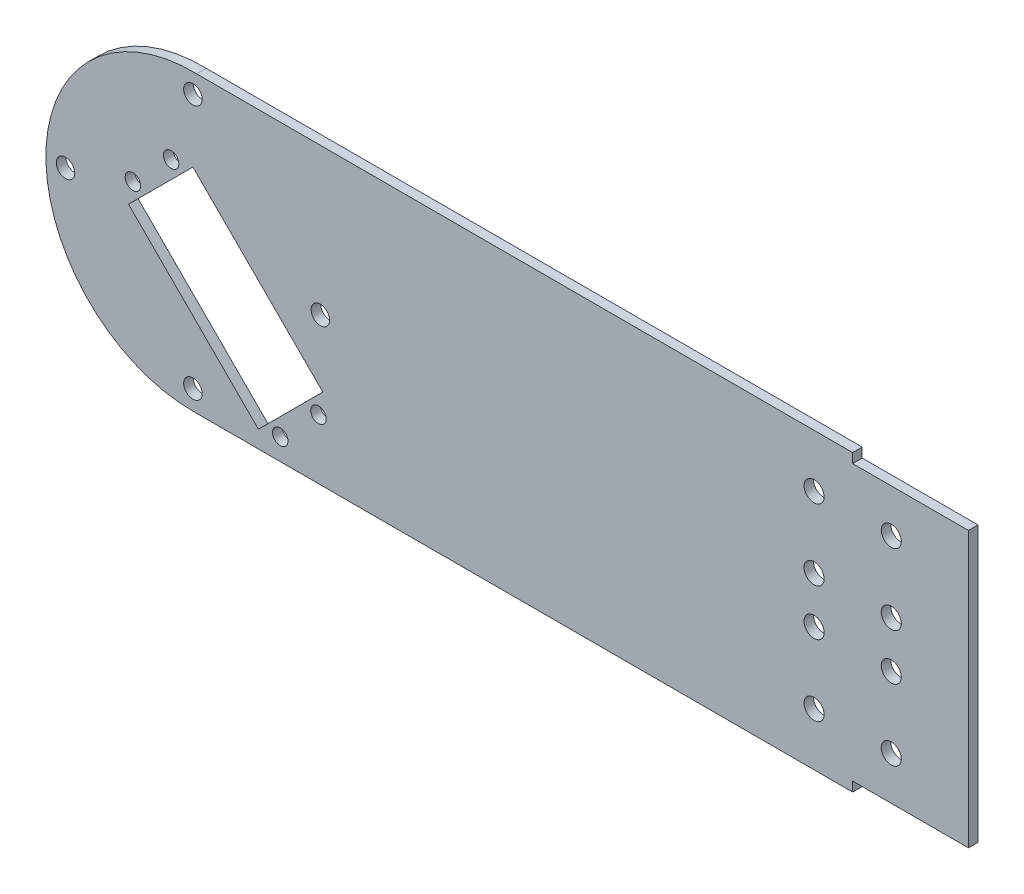
ISO-10303-21;
HEADER;
FILE_DESCRIPTION(('STEP AP214'),'2;1');
FILE_NAME('part.step','',(''),(''),'','','');
FILE_SCHEMA(('AUTOMOTIVE_DESIGN { 1 0 10303 214 1 1 1 1 }'));
ENDSEC;
DATA;
#1=APPLICATION_CONTEXT('core data for automotive mechanical design processes');
#2=APPLICATION_PROTOCOL_DEFINITION('international standard','automotive_design',2000,#1);
#3=PRODUCT_CONTEXT('',#1,'mechanical');
#4=PRODUCT('Part','Part','',(#3));
#5=PRODUCT_RELATED_PRODUCT_CATEGORY('part','',(#4));
#6=PRODUCT_DEFINITION_FORMATION('','',#4);
#7=PRODUCT_DEFINITION_CONTEXT('part definition',#1,'design');
#8=PRODUCT_DEFINITION('design','',#6,#7);
#9=PRODUCT_DEFINITION_SHAPE('','',#8);
#10=(LENGTH_UNIT() NAMED_UNIT(*) SI_UNIT(.MILLI.,.METRE.));
#11=(NAMED_UNIT(*) PLANE_ANGLE_UNIT() SI_UNIT($,.RADIAN.));
#12=(NAMED_UNIT(*) SI_UNIT($,.STERADIAN.) SOLID_ANGLE_UNIT());
#13=UNCERTAINTY_MEASURE_WITH_UNIT(LENGTH_MEASURE(1.E-05),#10,'distance_accuracy_value','');
#14=(GEOMETRIC_REPRESENTATION_CONTEXT(3) GLOBAL_UNCERTAINTY_ASSIGNED_CONTEXT((#13)) GLOBAL_UNIT_ASSIGNED_CONTEXT((#10,
#11,#12)) REPRESENTATION_CONTEXT('',''));
#15=CARTESIAN_POINT('',(0.,0.,0.));
#16=DIRECTION('',(0.,0.,1.));
#17=DIRECTION('',(1.,0.,0.));
#18=AXIS2_PLACEMENT_3D('',#15,#16,#17);
#19=CARTESIAN_POINT('',(0.,0.,3.1));
#20=DIRECTION('',(0.,0.,1.));
#21=DIRECTION('',(1.,0.,0.));
#22=AXIS2_PLACEMENT_3D('',#19,#20,#21);
#23=PLANE('',#22);
#24=CARTESIAN_POINT('',(201.19692414144,30.5249999999998,3.1));
#25=DIRECTION('',(0.,0.,1.));
#26=DIRECTION('',(-1.,0.,0.));
#27=AXIS2_PLACEMENT_3D('',#24,#25,#26);
#28=CIRCLE('',#27,3.25000000000001);
#29=CARTESIAN_POINT('',(197.94692414144,30.5249999999998,3.1));
#30=VERTEX_POINT('',#29);
#31=EDGE_CURVE('E460',#30,#30,#28,.T.);
#32=ORIENTED_EDGE('',*,*,#31,.F.);
#33=EDGE_LOOP('',(#32));
#34=FACE_BOUND('',#33,.T.);
#35=CARTESIAN_POINT('',(201.19692414144,7.52499999999982,3.1));
#36=DIRECTION('',(0.,0.,1.));
#37=DIRECTION('',(-1.,0.,0.));
#38=AXIS2_PLACEMENT_3D('',#35,#36,#37);
#39=CIRCLE('',#38,3.25000000000001);
#40=CARTESIAN_POINT('',(197.94692414144,7.52499999999982,3.1));
#41=VERTEX_POINT('',#40);
#42=EDGE_CURVE('E462',#41,#41,#39,.T.);
#43=ORIENTED_EDGE('',*,*,#42,.F.);
#44=EDGE_LOOP('',(#43));
#45=FACE_BOUND('',#44,.T.);
#46=CARTESIAN_POINT('',(201.19692414144,-7.52500000000017,3.1));
#47=DIRECTION('',(0.,0.,1.));
#48=DIRECTION('',(1.,0.,0.));
#49=AXIS2_PLACEMENT_3D('',#46,#47,#48);
#50=CIRCLE('',#49,3.25000000000001);
#51=CARTESIAN_POINT('',(204.44692414144,-7.52500000000017,3.1));
#52=VERTEX_POINT('',#51);
#53=EDGE_CURVE('E468',#52,#52,#50,.T.);
#54=ORIENTED_EDGE('',*,*,#53,.F.);
#55=EDGE_LOOP('',(#54));
#56=FACE_BOUND('',#55,.T.);
#57=CARTESIAN_POINT('',(201.19692414144,-30.5250000000002,3.1));
#58=DIRECTION('',(0.,0.,1.));
#59=DIRECTION('',(1.,0.,0.));
#60=AXIS2_PLACEMENT_3D('',#57,#58,#59);
#61=CIRCLE('',#60,3.25000000000001);
#62=CARTESIAN_POINT('',(204.44692414144,-30.5250000000002,3.1));
#63=VERTEX_POINT('',#62);
#64=EDGE_CURVE('E474',#63,#63,#61,.T.);
#65=ORIENTED_EDGE('',*,*,#64,.F.);
#66=EDGE_LOOP('',(#65));
#67=FACE_BOUND('',#66,.T.);
#68=CARTESIAN_POINT('',(226.19692414144,30.525,3.1));
#69=DIRECTION('',(0.,0.,1.));
#70=DIRECTION('',(-1.,0.,0.));
#71=AXIS2_PLACEMENT_3D('',#68,#69,#70);
#72=CIRCLE('',#71,3.25000000000001);
#73=CARTESIAN_POINT('',(222.94692414144,30.525,3.1));
#74=VERTEX_POINT('',#73);
#75=EDGE_CURVE('E480',#74,#74,#72,.T.);
#76=ORIENTED_EDGE('',*,*,#75,.F.);
#77=EDGE_LOOP('',(#76));
#78=FACE_BOUND('',#77,.T.);
#79=CARTESIAN_POINT('',(226.19692414144,7.52499999999999,3.1));
#80=DIRECTION('',(0.,0.,1.));
#81=DIRECTION('',(-1.,0.,0.));
#82=AXIS2_PLACEMENT_3D('',#79,#80,#81);
#83=CIRCLE('',#82,3.25000000000001);
#84=CARTESIAN_POINT('',(222.94692414144,7.52499999999999,3.1));
#85=VERTEX_POINT('',#84);
#86=EDGE_CURVE('E486',#85,#85,#83,.T.);
#87=ORIENTED_EDGE('',*,*,#86,.F.);
#88=EDGE_LOOP('',(#87));
#89=FACE_BOUND('',#88,.T.);
#90=CARTESIAN_POINT('',(226.19692414144,-7.525,3.1));
#91=DIRECTION('',(0.,0.,1.));
#92=DIRECTION('',(1.,0.,0.));
#93=AXIS2_PLACEMENT_3D('',#90,#91,#92);
#94=CIRCLE('',#93,3.25000000000001);
#95=CARTESIAN_POINT('',(229.44692414144,-7.525,3.1));
#96=VERTEX_POINT('',#95);
#97=EDGE_CURVE('E492',#96,#96,#94,.T.);
#98=ORIENTED_EDGE('',*,*,#97,.F.);
#99=EDGE_LOOP('',(#98));
#100=FACE_BOUND('',#99,.T.);
#101=CARTESIAN_POINT('',(226.19692414144,-30.525,3.1));
#102=DIRECTION('',(0.,0.,1.));
#103=DIRECTION('',(1.,0.,0.));
#104=AXIS2_PLACEMENT_3D('',#101,#102,#103);
#105=CIRCLE('',#104,3.25000000000001);
#106=CARTESIAN_POINT('',(229.44692414144,-30.525,3.1));
#107=VERTEX_POINT('',#106);
#108=EDGE_CURVE('E205',#107,#107,#105,.T.);
#109=ORIENTED_EDGE('',*,*,#108,.F.);
#110=EDGE_LOOP('',(#109));
#111=FACE_BOUND('',#110,.T.);
#112=CARTESIAN_POINT('',(28.2842712474618,-40.6586399182266,3.1));
#113=DIRECTION('',(0.,0.,-1.));
#114=DIRECTION('',(-1.,0.,0.));
#115=AXIS2_PLACEMENT_3D('',#112,#113,#114);
#116=CIRCLE('',#115,2.50000000000001);
#117=CARTESIAN_POINT('',(25.7842712474618,-40.6586399182266,3.1));
#118=VERTEX_POINT('',#117);
#119=EDGE_CURVE('E234',#118,#118,#116,.T.);
#120=ORIENTED_EDGE('',*,*,#119,.T.);
#121=EDGE_LOOP('',(#120));
#122=FACE_BOUND('',#121,.T.);
#123=CARTESIAN_POINT('',(40.6586399182264,-28.2842712474621,3.1));
#124=DIRECTION('',(0.,0.,1.));
#125=DIRECTION('',(1.,0.,0.));
#126=AXIS2_PLACEMENT_3D('',#123,#124,#125);
#127=CIRCLE('',#126,2.5);
#128=CARTESIAN_POINT('',(43.1586399182264,-28.2842712474621,3.1));
#129=VERTEX_POINT('',#128);
#130=EDGE_CURVE('E240',#129,#129,#127,.T.);
#131=ORIENTED_EDGE('',*,*,#130,.F.);
#132=EDGE_LOOP('',(#131));
#133=FACE_BOUND('',#132,.T.);
#134=CARTESIAN_POINT('',(-7.07106781186548,19.4454364826301,3.1));
#135=DIRECTION('',(0.,0.,-1.));
#136=DIRECTION('',(-1.,0.,0.));
#137=AXIS2_PLACEMENT_3D('',#134,#135,#136);
#138=CIRCLE('',#137,2.5);
#139=CARTESIAN_POINT('',(-9.57106781186548,19.4454364826301,3.1));
#140=VERTEX_POINT('',#139);
#141=EDGE_CURVE('E269',#140,#140,#138,.T.);
#142=ORIENTED_EDGE('',*,*,#141,.T.);
#143=EDGE_LOOP('',(#142));
#144=FACE_BOUND('',#143,.T.);
#145=CARTESIAN_POINT('',(5.73843931170054E-13,41.275,3.1));
#146=DIRECTION('',(0.,0.,1.));
#147=DIRECTION('',(1.,0.,0.));
#148=AXIS2_PLACEMENT_3D('',#145,#146,#147);
#149=CIRCLE('',#148,3.);
#150=CARTESIAN_POINT('',(3.00000000000058,41.275,3.1));
#151=VERTEX_POINT('',#150);
#152=EDGE_CURVE('E290',#151,#151,#149,.T.);
#153=ORIENTED_EDGE('',*,*,#152,.F.);
#154=EDGE_LOOP('',(#153));
#155=FACE_BOUND('',#154,.T.);
#156=CARTESIAN_POINT('',(0.,-41.275,3.1));
#157=DIRECTION('',(0.,0.,1.));
#158=DIRECTION('',(1.,0.,0.));
#159=AXIS2_PLACEMENT_3D('',#156,#157,#158);
#160=CIRCLE('',#159,3.);
#161=CARTESIAN_POINT('',(3.,-41.275,3.1));
#162=VERTEX_POINT('',#161);
#163=EDGE_CURVE('E302',#162,#162,#160,.T.);
#164=ORIENTED_EDGE('',*,*,#163,.F.);
#165=EDGE_LOOP('',(#164));
#166=FACE_BOUND('',#165,.T.);
#167=CARTESIAN_POINT('',(-41.2749999999997,2.8796409701215E-13,3.1));
#168=DIRECTION('',(0.,0.,1.));
#169=DIRECTION('',(1.,0.,0.));
#170=AXIS2_PLACEMENT_3D('',#167,#168,#169);
#171=CIRCLE('',#170,3.);
#172=CARTESIAN_POINT('',(-38.2749999999997,2.8796409701215E-13,3.1));
#173=VERTEX_POINT('',#172);
#174=EDGE_CURVE('E296',#173,#173,#171,.T.);
#175=ORIENTED_EDGE('',*,*,#174,.F.);
#176=EDGE_LOOP('',(#175));
#177=FACE_BOUND('',#176,.T.);
#178=CARTESIAN_POINT('',(41.2750000000003,-2.88397777881144E-13,3.1));
#179=DIRECTION('',(0.,0.,1.));
#180=DIRECTION('',(1.,0.,0.));
#181=AXIS2_PLACEMENT_3D('',#178,#179,#180);
#182=CIRCLE('',#181,3.);
#183=CARTESIAN_POINT('',(44.2750000000003,-2.88397777881144E-13,3.1));
#184=VERTEX_POINT('',#183);
#185=EDGE_CURVE('E284',#184,#184,#182,.T.);
#186=ORIENTED_EDGE('',*,*,#185,.F.);
#187=EDGE_LOOP('',(#186));
#188=FACE_BOUND('',#187,.T.);
#189=DIRECTION('',(0.707106781186544,0.707106781186551,0.));
#190=VECTOR('',#189,1.);
#191=CARTESIAN_POINT('',(21.2132034355965,-42.0728534805997,3.1));
#192=LINE('',#191,#190);
#193=CARTESIAN_POINT('',(21.2132034355965,-42.0728534805997,3.1));
#194=VERTEX_POINT('',#193);
#195=CARTESIAN_POINT('',(42.0728534805995,-21.2132034355965,3.1));
#196=VERTEX_POINT('',#195);
#197=EDGE_CURVE('E256',#194,#196,#192,.T.);
#198=ORIENTED_EDGE('',*,*,#197,.F.);
#199=DIRECTION('',(-0.707106781186546,0.707106781186549,0.));
#200=VECTOR('',#199,1.);
#201=CARTESIAN_POINT('',(21.2132034355965,-42.0728534805997,3.1));
#202=LINE('',#201,#200);
#203=CARTESIAN_POINT('',(-20.8596500450031,0.,3.1));
#204=VERTEX_POINT('',#203);
#205=EDGE_CURVE('E266',#194,#204,#202,.T.);
#206=ORIENTED_EDGE('',*,*,#205,.T.);
#207=DIRECTION('',(0.707106781186548,0.707106781186548,0.));
#208=VECTOR('',#207,1.);
#209=CARTESIAN_POINT('',(-20.8596500450031,0.,3.1));
#210=LINE('',#209,#208);
#211=CARTESIAN_POINT('',(0.,20.8596500450032,3.1));
#212=VERTEX_POINT('',#211);
#213=EDGE_CURVE('E263',#204,#212,#210,.T.);
#214=ORIENTED_EDGE('',*,*,#213,.T.);
#215=DIRECTION('',(-0.707106781186546,0.707106781186549,0.));
#216=VECTOR('',#215,1.);
#217=CARTESIAN_POINT('',(42.0728534805995,-21.2132034355965,3.1));
#218=LINE('',#217,#216);
#219=EDGE_CURVE('E259',#196,#212,#218,.T.);
#220=ORIENTED_EDGE('',*,*,#219,.F.);
#221=EDGE_LOOP('',(#198,#206,#214,#220));
#222=FACE_BOUND('',#221,.T.);
#223=CARTESIAN_POINT('',(-19.4454364826301,7.07106781186548,3.1));
#224=DIRECTION('',(0.,0.,1.));
#225=DIRECTION('',(1.,0.,0.));
#226=AXIS2_PLACEMENT_3D('',#223,#224,#225);
#227=CIRCLE('',#226,2.5);
#228=CARTESIAN_POINT('',(-16.9454364826301,7.07106781186548,3.1));
#229=VERTEX_POINT('',#228);
#230=EDGE_CURVE('E228',#229,#229,#227,.T.);
#231=ORIENTED_EDGE('',*,*,#230,.F.);
#232=EDGE_LOOP('',(#231));
#233=FACE_BOUND('',#232,.T.);
#234=DIRECTION('',(0.,1.,0.));
#235=VECTOR('',#234,1.);
#236=CARTESIAN_POINT('',(251.19692414144,-47.625,3.1));
#237=LINE('',#236,#235);
#238=CARTESIAN_POINT('',(251.19692414144,-44.525,3.1));
#239=VERTEX_POINT('',#238);
#240=CARTESIAN_POINT('',(251.19692414144,44.525,3.1));
#241=VERTEX_POINT('',#240);
#242=EDGE_CURVE('E314',#239,#241,#237,.T.);
#243=ORIENTED_EDGE('',*,*,#242,.T.);
#244=DIRECTION('',(-1.,0.,0.));
#245=VECTOR('',#244,1.);
#246=CARTESIAN_POINT('',(251.19692414144,44.525,3.1));
#247=LINE('',#246,#245);
#248=CARTESIAN_POINT('',(213.69692414144,44.525,3.1));
#249=VERTEX_POINT('',#248);
#250=EDGE_CURVE('E201',#241,#249,#247,.T.);
#251=ORIENTED_EDGE('',*,*,#250,.T.);
#252=DIRECTION('',(0.,1.,0.));
#253=VECTOR('',#252,1.);
#254=CARTESIAN_POINT('',(213.69692414144,47.625,3.1));
#255=LINE('',#254,#253);
#256=CARTESIAN_POINT('',(213.69692414144,47.6099569165909,3.1));
#257=VERTEX_POINT('',#256);
#258=EDGE_CURVE('E194',#249,#257,#255,.T.);
#259=ORIENTED_EDGE('',*,*,#258,.T.);
#260=DIRECTION('',(-1.,0.,0.));
#261=VECTOR('',#260,1.);
#262=CARTESIAN_POINT('',(251.19692414144,47.6099569165909,3.1));
#263=LINE('',#262,#261);
#264=CARTESIAN_POINT('',(1.19692414144043,47.6099569165909,3.1));
#265=VERTEX_POINT('',#264);
#266=EDGE_CURVE('E317',#257,#265,#263,.T.);
#267=ORIENTED_EDGE('',*,*,#266,.T.);
#268=CARTESIAN_POINT('',(0.,0.,3.1));
#269=DIRECTION('',(0.,0.,1.));
#270=DIRECTION('',(1.,0.,0.));
#271=AXIS2_PLACEMENT_3D('',#268,#269,#270);
#272=CIRCLE('',#271,47.625);
#273=CARTESIAN_POINT('',(0.,-47.625,3.1));
#274=VERTEX_POINT('',#273);
#275=EDGE_CURVE('E308',#265,#274,#272,.T.);
#276=ORIENTED_EDGE('',*,*,#275,.T.);
#277=DIRECTION('',(1.,0.,0.));
#278=VECTOR('',#277,1.);
#279=CARTESIAN_POINT('',(0.,-47.625,3.1));
#280=LINE('',#279,#278);
#281=CARTESIAN_POINT('',(213.69692414144,-47.625,3.1));
#282=VERTEX_POINT('',#281);
#283=EDGE_CURVE('E311',#274,#282,#280,.T.);
#284=ORIENTED_EDGE('',*,*,#283,.T.);
#285=DIRECTION('',(0.,-1.,0.));
#286=VECTOR('',#285,1.);
#287=CARTESIAN_POINT('',(213.69692414144,-47.625,3.1));
#288=LINE('',#287,#286);
#289=CARTESIAN_POINT('',(213.69692414144,-44.525,3.1));
#290=VERTEX_POINT('',#289);
#291=EDGE_CURVE('E214',#290,#282,#288,.T.);
#292=ORIENTED_EDGE('',*,*,#291,.F.);
#293=DIRECTION('',(-1.,0.,0.));
#294=VECTOR('',#293,1.);
#295=CARTESIAN_POINT('',(251.19692414144,-44.525,3.1));
#296=LINE('',#295,#294);
#297=EDGE_CURVE('E210',#239,#290,#296,.T.);
#298=ORIENTED_EDGE('',*,*,#297,.F.);
#299=EDGE_LOOP('',(#243,#251,#259,#267,#276,#284,#292,#298));
#300=FACE_BOUND('',#299,.T.);
#301=ADVANCED_FACE('F94',(#34,#45,#56,#67,#78,#89,#100,#111,#122,#133,#144,#155,#166,#177,#188,
#222,#233,#300),#23,.T.);
#302=CARTESIAN_POINT('',(0.,0.,0.));
#303=DIRECTION('',(0.,0.,1.));
#304=DIRECTION('',(1.,0.,0.));
#305=AXIS2_PLACEMENT_3D('',#302,#303,#304);
#306=PLANE('',#305);
#307=CARTESIAN_POINT('',(201.19692414144,30.5249999999998,0.));
#308=DIRECTION('',(0.,0.,1.));
#309=DIRECTION('',(-1.,0.,0.));
#310=AXIS2_PLACEMENT_3D('',#307,#308,#309);
#311=CIRCLE('',#310,3.25000000000001);
#312=CARTESIAN_POINT('',(197.94692414144,30.5249999999998,0.));
#313=VERTEX_POINT('',#312);
#314=EDGE_CURVE('E458',#313,#313,#311,.T.);
#315=ORIENTED_EDGE('',*,*,#314,.T.);
#316=EDGE_LOOP('',(#315));
#317=FACE_BOUND('',#316,.T.);
#318=CARTESIAN_POINT('',(201.19692414144,7.52499999999982,0.));
#319=DIRECTION('',(0.,0.,1.));
#320=DIRECTION('',(-1.,0.,0.));
#321=AXIS2_PLACEMENT_3D('',#318,#319,#320);
#322=CIRCLE('',#321,3.25000000000001);
#323=CARTESIAN_POINT('',(197.94692414144,7.52499999999982,0.));
#324=VERTEX_POINT('',#323);
#325=EDGE_CURVE('E465',#324,#324,#322,.T.);
#326=ORIENTED_EDGE('',*,*,#325,.T.);
#327=EDGE_LOOP('',(#326));
#328=FACE_BOUND('',#327,.T.);
#329=CARTESIAN_POINT('',(201.19692414144,-7.52500000000017,0.));
#330=DIRECTION('',(0.,0.,1.));
#331=DIRECTION('',(1.,0.,0.));
#332=AXIS2_PLACEMENT_3D('',#329,#330,#331);
#333=CIRCLE('',#332,3.25000000000001);
#334=CARTESIAN_POINT('',(204.44692414144,-7.52500000000017,0.));
#335=VERTEX_POINT('',#334);
#336=EDGE_CURVE('E471',#335,#335,#333,.T.);
#337=ORIENTED_EDGE('',*,*,#336,.T.);
#338=EDGE_LOOP('',(#337));
#339=FACE_BOUND('',#338,.T.);
#340=CARTESIAN_POINT('',(201.19692414144,-30.5250000000002,0.));
#341=DIRECTION('',(0.,0.,1.));
#342=DIRECTION('',(1.,0.,0.));
#343=AXIS2_PLACEMENT_3D('',#340,#341,#342);
#344=CIRCLE('',#343,3.25000000000001);
#345=CARTESIAN_POINT('',(204.44692414144,-30.5250000000002,0.));
#346=VERTEX_POINT('',#345);
#347=EDGE_CURVE('E477',#346,#346,#344,.T.);
#348=ORIENTED_EDGE('',*,*,#347,.T.);
#349=EDGE_LOOP('',(#348));
#350=FACE_BOUND('',#349,.T.);
#351=CARTESIAN_POINT('',(226.19692414144,30.525,0.));
#352=DIRECTION('',(0.,0.,1.));
#353=DIRECTION('',(-1.,0.,0.));
#354=AXIS2_PLACEMENT_3D('',#351,#352,#353);
#355=CIRCLE('',#354,3.25000000000001);
#356=CARTESIAN_POINT('',(222.94692414144,30.525,0.));
#357=VERTEX_POINT('',#356);
#358=EDGE_CURVE('E483',#357,#357,#355,.T.);
#359=ORIENTED_EDGE('',*,*,#358,.T.);
#360=EDGE_LOOP('',(#359));
#361=FACE_BOUND('',#360,.T.);
#362=CARTESIAN_POINT('',(226.19692414144,7.52499999999999,0.));
#363=DIRECTION('',(0.,0.,1.));
#364=DIRECTION('',(-1.,0.,0.));
#365=AXIS2_PLACEMENT_3D('',#362,#363,#364);
#366=CIRCLE('',#365,3.25000000000001);
#367=CARTESIAN_POINT('',(222.94692414144,7.52499999999999,0.));
#368=VERTEX_POINT('',#367);
#369=EDGE_CURVE('E489',#368,#368,#366,.T.);
#370=ORIENTED_EDGE('',*,*,#369,.T.);
#371=EDGE_LOOP('',(#370));
#372=FACE_BOUND('',#371,.T.);
#373=CARTESIAN_POINT('',(226.19692414144,-7.525,0.));
#374=DIRECTION('',(0.,0.,1.));
#375=DIRECTION('',(1.,0.,0.));
#376=AXIS2_PLACEMENT_3D('',#373,#374,#375);
#377=CIRCLE('',#376,3.25000000000001);
#378=CARTESIAN_POINT('',(229.44692414144,-7.525,0.));
#379=VERTEX_POINT('',#378);
#380=EDGE_CURVE('E495',#379,#379,#377,.T.);
#381=ORIENTED_EDGE('',*,*,#380,.T.);
#382=EDGE_LOOP('',(#381));
#383=FACE_BOUND('',#382,.T.);
#384=CARTESIAN_POINT('',(226.19692414144,-30.525,0.));
#385=DIRECTION('',(0.,0.,1.));
#386=DIRECTION('',(1.,0.,0.));
#387=AXIS2_PLACEMENT_3D('',#384,#385,#386);
#388=CIRCLE('',#387,3.25000000000001);
#389=CARTESIAN_POINT('',(229.44692414144,-30.525,0.));
#390=VERTEX_POINT('',#389);
#391=EDGE_CURVE('E208',#390,#390,#388,.T.);
#392=ORIENTED_EDGE('',*,*,#391,.T.);
#393=EDGE_LOOP('',(#392));
#394=FACE_BOUND('',#393,.T.);
#395=CARTESIAN_POINT('',(28.2842712474618,-40.6586399182266,0.));
#396=DIRECTION('',(0.,0.,-1.));
#397=DIRECTION('',(-1.,0.,0.));
#398=AXIS2_PLACEMENT_3D('',#395,#396,#397);
#399=CIRCLE('',#398,2.50000000000001);
#400=CARTESIAN_POINT('',(25.7842712474618,-40.6586399182266,0.));
#401=VERTEX_POINT('',#400);
#402=EDGE_CURVE('E231',#401,#401,#399,.T.);
#403=ORIENTED_EDGE('',*,*,#402,.F.);
#404=EDGE_LOOP('',(#403));
#405=FACE_BOUND('',#404,.T.);
#406=CARTESIAN_POINT('',(40.6586399182264,-28.2842712474621,0.));
#407=DIRECTION('',(0.,0.,1.));
#408=DIRECTION('',(1.,0.,0.));
#409=AXIS2_PLACEMENT_3D('',#406,#407,#408);
#410=CIRCLE('',#409,2.5);
#411=CARTESIAN_POINT('',(43.1586399182264,-28.2842712474621,0.));
#412=VERTEX_POINT('',#411);
#413=EDGE_CURVE('E237',#412,#412,#410,.T.);
#414=ORIENTED_EDGE('',*,*,#413,.T.);
#415=EDGE_LOOP('',(#414));
#416=FACE_BOUND('',#415,.T.);
#417=CARTESIAN_POINT('',(-7.07106781186548,19.4454364826301,0.));
#418=DIRECTION('',(0.,0.,-1.));
#419=DIRECTION('',(-1.,0.,0.));
#420=AXIS2_PLACEMENT_3D('',#417,#418,#419);
#421=CIRCLE('',#420,2.5);
#422=CARTESIAN_POINT('',(-9.57106781186548,19.4454364826301,0.));
#423=VERTEX_POINT('',#422);
#424=EDGE_CURVE('E278',#423,#423,#421,.T.);
#425=ORIENTED_EDGE('',*,*,#424,.F.);
#426=EDGE_LOOP('',(#425));
#427=FACE_BOUND('',#426,.T.);
#428=CARTESIAN_POINT('',(5.73843931170054E-13,41.275,0.));
#429=DIRECTION('',(0.,0.,1.));
#430=DIRECTION('',(1.,0.,0.));
#431=AXIS2_PLACEMENT_3D('',#428,#429,#430);
#432=CIRCLE('',#431,3.);
#433=CARTESIAN_POINT('',(3.00000000000058,41.275,0.));
#434=VERTEX_POINT('',#433);
#435=EDGE_CURVE('E287',#434,#434,#432,.T.);
#436=ORIENTED_EDGE('',*,*,#435,.T.);
#437=EDGE_LOOP('',(#436));
#438=FACE_BOUND('',#437,.T.);
#439=CARTESIAN_POINT('',(0.,-41.275,0.));
#440=DIRECTION('',(0.,0.,1.));
#441=DIRECTION('',(1.,0.,0.));
#442=AXIS2_PLACEMENT_3D('',#439,#440,#441);
#443=CIRCLE('',#442,3.);
#444=CARTESIAN_POINT('',(3.,-41.275,0.));
#445=VERTEX_POINT('',#444);
#446=EDGE_CURVE('E299',#445,#445,#443,.T.);
#447=ORIENTED_EDGE('',*,*,#446,.T.);
#448=EDGE_LOOP('',(#447));
#449=FACE_BOUND('',#448,.T.);
#450=CARTESIAN_POINT('',(-41.2749999999997,2.8796409701215E-13,0.));
#451=DIRECTION('',(0.,0.,1.));
#452=DIRECTION('',(1.,0.,0.));
#453=AXIS2_PLACEMENT_3D('',#450,#451,#452);
#454=CIRCLE('',#453,3.);
#455=CARTESIAN_POINT('',(-38.2749999999997,2.8796409701215E-13,0.));
#456=VERTEX_POINT('',#455);
#457=EDGE_CURVE('E293',#456,#456,#454,.T.);
#458=ORIENTED_EDGE('',*,*,#457,.T.);
#459=EDGE_LOOP('',(#458));
#460=FACE_BOUND('',#459,.T.);
#461=CARTESIAN_POINT('',(41.2750000000003,-2.88397777881144E-13,0.));
#462=DIRECTION('',(0.,0.,1.));
#463=DIRECTION('',(1.,0.,0.));
#464=AXIS2_PLACEMENT_3D('',#461,#462,#463);
#465=CIRCLE('',#464,3.);
#466=CARTESIAN_POINT('',(44.2750000000003,-2.88397777881144E-13,0.));
#467=VERTEX_POINT('',#466);
#468=EDGE_CURVE('E281',#467,#467,#465,.T.);
#469=ORIENTED_EDGE('',*,*,#468,.T.);
#470=EDGE_LOOP('',(#469));
#471=FACE_BOUND('',#470,.T.);
#472=DIRECTION('',(-0.707106781186546,0.707106781186549,0.));
#473=VECTOR('',#472,1.);
#474=CARTESIAN_POINT('',(21.2132034355965,-42.0728534805997,0.));
#475=LINE('',#474,#473);
#476=CARTESIAN_POINT('',(21.2132034355965,-42.0728534805997,0.));
#477=VERTEX_POINT('',#476);
#478=CARTESIAN_POINT('',(-20.8596500450031,0.,0.));
#479=VERTEX_POINT('',#478);
#480=EDGE_CURVE('E260',#477,#479,#475,.T.);
#481=ORIENTED_EDGE('',*,*,#480,.F.);
#482=DIRECTION('',(0.707106781186544,0.707106781186551,0.));
#483=VECTOR('',#482,1.);
#484=CARTESIAN_POINT('',(21.2132034355965,-42.0728534805997,0.));
#485=LINE('',#484,#483);
#486=CARTESIAN_POINT('',(42.0728534805995,-21.2132034355965,0.));
#487=VERTEX_POINT('',#486);
#488=EDGE_CURVE('E255',#477,#487,#485,.T.);
#489=ORIENTED_EDGE('',*,*,#488,.T.);
#490=DIRECTION('',(-0.707106781186546,0.707106781186549,0.));
#491=VECTOR('',#490,1.);
#492=CARTESIAN_POINT('',(42.0728534805995,-21.2132034355965,0.));
#493=LINE('',#492,#491);
#494=CARTESIAN_POINT('',(0.,20.8596500450032,0.));
#495=VERTEX_POINT('',#494);
#496=EDGE_CURVE('E272',#487,#495,#493,.T.);
#497=ORIENTED_EDGE('',*,*,#496,.T.);
#498=DIRECTION('',(0.707106781186548,0.707106781186548,0.));
#499=VECTOR('',#498,1.);
#500=CARTESIAN_POINT('',(-20.8596500450031,0.,0.));
#501=LINE('',#500,#499);
#502=EDGE_CURVE('E275',#479,#495,#501,.T.);
#503=ORIENTED_EDGE('',*,*,#502,.F.);
#504=EDGE_LOOP('',(#481,#489,#497,#503));
#505=FACE_BOUND('',#504,.T.);
#506=CARTESIAN_POINT('',(-19.4454364826301,7.07106781186548,0.));
#507=DIRECTION('',(0.,0.,1.));
#508=DIRECTION('',(1.,0.,0.));
#509=AXIS2_PLACEMENT_3D('',#506,#507,#508);
#510=CIRCLE('',#509,2.5);
#511=CARTESIAN_POINT('',(-16.9454364826301,7.07106781186548,0.));
#512=VERTEX_POINT('',#511);
#513=EDGE_CURVE('E224',#512,#512,#510,.T.);
#514=ORIENTED_EDGE('',*,*,#513,.T.);
#515=EDGE_LOOP('',(#514));
#516=FACE_BOUND('',#515,.T.);
#517=DIRECTION('',(-1.,0.,0.));
#518=VECTOR('',#517,1.);
#519=CARTESIAN_POINT('',(251.19692414144,44.525,0.));
#520=LINE('',#519,#518);
#521=CARTESIAN_POINT('',(251.19692414144,44.525,0.));
#522=VERTEX_POINT('',#521);
#523=CARTESIAN_POINT('',(213.69692414144,44.525,0.));
#524=VERTEX_POINT('',#523);
#525=EDGE_CURVE('E182',#522,#524,#520,.T.);
#526=ORIENTED_EDGE('',*,*,#525,.F.);
#527=DIRECTION('',(0.,1.,0.));
#528=VECTOR('',#527,1.);
#529=CARTESIAN_POINT('',(251.19692414144,-47.625,0.));
#530=LINE('',#529,#528);
#531=CARTESIAN_POINT('',(251.19692414144,-44.525,0.));
#532=VERTEX_POINT('',#531);
#533=EDGE_CURVE('E325',#532,#522,#530,.T.);
#534=ORIENTED_EDGE('',*,*,#533,.F.);
#535=DIRECTION('',(-1.,0.,0.));
#536=VECTOR('',#535,1.);
#537=CARTESIAN_POINT('',(251.19692414144,-44.525,0.));
#538=LINE('',#537,#536);
#539=CARTESIAN_POINT('',(213.69692414144,-44.525,0.));
#540=VERTEX_POINT('',#539);
#541=EDGE_CURVE('E116',#532,#540,#538,.T.);
#542=ORIENTED_EDGE('',*,*,#541,.T.);
#543=DIRECTION('',(0.,-1.,0.));
#544=VECTOR('',#543,1.);
#545=CARTESIAN_POINT('',(213.69692414144,-47.625,0.));
#546=LINE('',#545,#544);
#547=CARTESIAN_POINT('',(213.69692414144,-47.625,0.));
#548=VERTEX_POINT('',#547);
#549=EDGE_CURVE('E213',#540,#548,#546,.T.);
#550=ORIENTED_EDGE('',*,*,#549,.T.);
#551=DIRECTION('',(1.,0.,0.));
#552=VECTOR('',#551,1.);
#553=CARTESIAN_POINT('',(0.,-47.625,0.));
#554=LINE('',#553,#552);
#555=CARTESIAN_POINT('',(0.,-47.625,0.));
#556=VERTEX_POINT('',#555);
#557=EDGE_CURVE('E322',#556,#548,#554,.T.);
#558=ORIENTED_EDGE('',*,*,#557,.F.);
#559=CARTESIAN_POINT('',(0.,0.,0.));
#560=DIRECTION('',(0.,0.,1.));
#561=DIRECTION('',(1.,0.,0.));
#562=AXIS2_PLACEMENT_3D('',#559,#560,#561);
#563=CIRCLE('',#562,47.625);
#564=CARTESIAN_POINT('',(1.19692414144043,47.6099569165909,0.));
#565=VERTEX_POINT('',#564);
#566=EDGE_CURVE('E305',#565,#556,#563,.T.);
#567=ORIENTED_EDGE('',*,*,#566,.F.);
#568=DIRECTION('',(-1.,0.,0.));
#569=VECTOR('',#568,1.);
#570=CARTESIAN_POINT('',(251.19692414144,47.6099569165909,0.));
#571=LINE('',#570,#569);
#572=CARTESIAN_POINT('',(213.69692414144,47.6099569165909,0.));
#573=VERTEX_POINT('',#572);
#574=EDGE_CURVE('E200',#573,#565,#571,.T.);
#575=ORIENTED_EDGE('',*,*,#574,.F.);
#576=DIRECTION('',(0.,1.,0.));
#577=VECTOR('',#576,1.);
#578=CARTESIAN_POINT('',(213.69692414144,47.625,0.));
#579=LINE('',#578,#577);
#580=EDGE_CURVE('E108',#524,#573,#579,.T.);
#581=ORIENTED_EDGE('',*,*,#580,.F.);
#582=EDGE_LOOP('',(#526,#534,#542,#550,#558,#567,#575,#581));
#583=FACE_BOUND('',#582,.T.);
#584=ADVANCED_FACE('F198',(#317,#328,#339,#350,#361,#372,#383,#394,#405,#416,#427,#438,#449,
#460,#471,#505,#516,#583),#306,.F.);
#585=CARTESIAN_POINT('',(251.19692414144,-47.625,3.1));
#586=DIRECTION('',(-1.,0.,0.));
#587=DIRECTION('',(0.,0.,1.));
#588=AXIS2_PLACEMENT_3D('',#585,#586,#587);
#589=PLANE('',#588);
#590=DIRECTION('',(0.,0.,1.));
#591=VECTOR('',#590,1.);
#592=CARTESIAN_POINT('',(251.19692414144,44.525,0.));
#593=LINE('',#592,#591);
#594=EDGE_CURVE('E187',#522,#241,#593,.T.);
#595=ORIENTED_EDGE('',*,*,#594,.T.);
#596=ORIENTED_EDGE('',*,*,#242,.F.);
#597=DIRECTION('',(0.,0.,1.));
#598=VECTOR('',#597,1.);
#599=CARTESIAN_POINT('',(251.19692414144,-44.525,0.));
#600=LINE('',#599,#598);
#601=EDGE_CURVE('E217',#532,#239,#600,.T.);
#602=ORIENTED_EDGE('',*,*,#601,.F.);
#603=ORIENTED_EDGE('',*,*,#533,.T.);
#604=EDGE_LOOP('',(#595,#596,#602,#603));
#605=FACE_BOUND('',#604,.T.);
#606=ADVANCED_FACE('F346',(#605),#589,.F.);
#607=CARTESIAN_POINT('',(251.19692414144,47.6099569165909,3.1));
#608=DIRECTION('',(0.,-1.,0.));
#609=DIRECTION('',(1.,0.,0.));
#610=AXIS2_PLACEMENT_3D('',#607,#608,#609);
#611=PLANE('',#610);
#612=DIRECTION('',(0.,0.,1.));
#613=VECTOR('',#612,1.);
#614=CARTESIAN_POINT('',(213.69692414144,47.6099569165909,3.1));
#615=LINE('',#614,#613);
#616=EDGE_CURVE('E12',#573,#257,#615,.T.);
#617=ORIENTED_EDGE('',*,*,#616,.F.);
#618=ORIENTED_EDGE('',*,*,#574,.T.);
#619=DIRECTION('',(0.,0.,-1.));
#620=VECTOR('',#619,1.);
#621=CARTESIAN_POINT('',(1.19692414144043,47.6099569165909,3.1));
#622=LINE('',#621,#620);
#623=EDGE_CURVE('E319',#265,#565,#622,.T.);
#624=ORIENTED_EDGE('',*,*,#623,.F.);
#625=ORIENTED_EDGE('',*,*,#266,.F.);
#626=EDGE_LOOP('',(#617,#618,#624,#625));
#627=FACE_BOUND('',#626,.T.);
#628=ADVANCED_FACE('F344',(#627),#611,.F.);
#629=CARTESIAN_POINT('',(0.,0.,3.1));
#630=DIRECTION('',(0.,0.,-1.));
#631=DIRECTION('',(-1.,0.,0.));
#632=AXIS2_PLACEMENT_3D('',#629,#630,#631);
#633=CYLINDRICAL_SURFACE('',#632,47.625);
#634=ORIENTED_EDGE('',*,*,#566,.T.);
#635=DIRECTION('',(0.,0.,-1.));
#636=VECTOR('',#635,1.);
#637=CARTESIAN_POINT('',(0.,-47.625,3.1));
#638=LINE('',#637,#636);
#639=EDGE_CURVE('E102',#274,#556,#638,.T.);
#640=ORIENTED_EDGE('',*,*,#639,.F.);
#641=ORIENTED_EDGE('',*,*,#275,.F.);
#642=ORIENTED_EDGE('',*,*,#623,.T.);
#643=EDGE_LOOP('',(#634,#640,#641,#642));
#644=FACE_BOUND('',#643,.T.);
#645=ADVANCED_FACE('F96',(#644),#633,.T.);
#646=CARTESIAN_POINT('',(0.,-47.625,3.1));
#647=DIRECTION('',(0.,1.,0.));
#648=DIRECTION('',(0.,0.,1.));
#649=AXIS2_PLACEMENT_3D('',#646,#647,#648);
#650=PLANE('',#649);
#651=ORIENTED_EDGE('',*,*,#557,.T.);
#652=DIRECTION('',(0.,0.,1.));
#653=VECTOR('',#652,1.);
#654=CARTESIAN_POINT('',(213.69692414144,-47.625,0.));
#655=LINE('',#654,#653);
#656=EDGE_CURVE('E221',#548,#282,#655,.T.);
#657=ORIENTED_EDGE('',*,*,#656,.T.);
#658=ORIENTED_EDGE('',*,*,#283,.F.);
#659=ORIENTED_EDGE('',*,*,#639,.T.);
#660=EDGE_LOOP('',(#651,#657,#658,#659));
#661=FACE_BOUND('',#660,.T.);
#662=ADVANCED_FACE('F332',(#661),#650,.F.);
#663=CARTESIAN_POINT('',(0.,-41.275,3.1));
#664=DIRECTION('',(0.,0.,-1.));
#665=DIRECTION('',(-1.,0.,0.));
#666=AXIS2_PLACEMENT_3D('',#663,#664,#665);
#667=CYLINDRICAL_SURFACE('',#666,3.);
#668=ORIENTED_EDGE('',*,*,#163,.T.);
#669=EDGE_LOOP('',(#668));
#670=FACE_BOUND('',#669,.T.);
#671=ORIENTED_EDGE('',*,*,#446,.F.);
#672=EDGE_LOOP('',(#671));
#673=FACE_BOUND('',#672,.T.);
#674=ADVANCED_FACE('F365',(#670,#673),#667,.F.);
#675=CARTESIAN_POINT('',(-41.2749999999997,2.8796409701215E-13,3.1));
#676=DIRECTION('',(0.,0.,-1.));
#677=DIRECTION('',(-1.,0.,0.));
#678=AXIS2_PLACEMENT_3D('',#675,#676,#677);
#679=CYLINDRICAL_SURFACE('',#678,3.);
#680=ORIENTED_EDGE('',*,*,#174,.T.);
#681=EDGE_LOOP('',(#680));
#682=FACE_BOUND('',#681,.T.);
#683=ORIENTED_EDGE('',*,*,#457,.F.);
#684=EDGE_LOOP('',(#683));
#685=FACE_BOUND('',#684,.T.);
#686=ADVANCED_FACE('F368',(#682,#685),#679,.F.);
#687=CARTESIAN_POINT('',(5.73843931170054E-13,41.275,3.1));
#688=DIRECTION('',(0.,0.,-1.));
#689=DIRECTION('',(-1.,0.,0.));
#690=AXIS2_PLACEMENT_3D('',#687,#688,#689);
#691=CYLINDRICAL_SURFACE('',#690,3.);
#692=ORIENTED_EDGE('',*,*,#152,.T.);
#693=EDGE_LOOP('',(#692));
#694=FACE_BOUND('',#693,.T.);
#695=ORIENTED_EDGE('',*,*,#435,.F.);
#696=EDGE_LOOP('',(#695));
#697=FACE_BOUND('',#696,.T.);
#698=ADVANCED_FACE('F372',(#694,#697),#691,.F.);
#699=CARTESIAN_POINT('',(41.2750000000003,-2.88397777881144E-13,3.1));
#700=DIRECTION('',(0.,0.,-1.));
#701=DIRECTION('',(-1.,0.,0.));
#702=AXIS2_PLACEMENT_3D('',#699,#700,#701);
#703=CYLINDRICAL_SURFACE('',#702,3.);
#704=ORIENTED_EDGE('',*,*,#185,.T.);
#705=EDGE_LOOP('',(#704));
#706=FACE_BOUND('',#705,.T.);
#707=ORIENTED_EDGE('',*,*,#468,.F.);
#708=EDGE_LOOP('',(#707));
#709=FACE_BOUND('',#708,.T.);
#710=ADVANCED_FACE('F376',(#706,#709),#703,.F.);
#711=CARTESIAN_POINT('',(-7.07106781186548,19.4454364826301,0.));
#712=DIRECTION('',(0.,0.,1.));
#713=DIRECTION('',(1.,0.,0.));
#714=AXIS2_PLACEMENT_3D('',#711,#712,#713);
#715=CYLINDRICAL_SURFACE('',#714,2.5);
#716=ORIENTED_EDGE('',*,*,#424,.T.);
#717=EDGE_LOOP('',(#716));
#718=FACE_BOUND('',#717,.T.);
#719=ORIENTED_EDGE('',*,*,#141,.F.);
#720=EDGE_LOOP('',(#719));
#721=FACE_BOUND('',#720,.T.);
#722=ADVANCED_FACE('F380',(#718,#721),#715,.F.);
#723=CARTESIAN_POINT('',(21.2132034355965,-42.0728534805997,0.));
#724=DIRECTION('',(0.707106781186549,0.707106781186546,0.));
#725=DIRECTION('',(-0.707106781186546,0.707106781186549,0.));
#726=AXIS2_PLACEMENT_3D('',#723,#724,#725);
#727=PLANE('',#726);
#728=ORIENTED_EDGE('',*,*,#205,.F.);
#729=DIRECTION('',(0.,0.,1.));
#730=VECTOR('',#729,1.);
#731=CARTESIAN_POINT('',(21.2132034355965,-42.0728534805997,0.));
#732=LINE('',#731,#730);
#733=EDGE_CURVE('E252',#477,#194,#732,.T.);
#734=ORIENTED_EDGE('',*,*,#733,.F.);
#735=ORIENTED_EDGE('',*,*,#480,.T.);
#736=DIRECTION('',(0.,0.,1.));
#737=VECTOR('',#736,1.);
#738=CARTESIAN_POINT('',(-20.8596500450031,0.,0.));
#739=LINE('',#738,#737);
#740=EDGE_CURVE('E243',#479,#204,#739,.T.);
#741=ORIENTED_EDGE('',*,*,#740,.T.);
#742=EDGE_LOOP('',(#728,#734,#735,#741));
#743=FACE_BOUND('',#742,.T.);
#744=ADVANCED_FACE('F384',(#743),#727,.T.);
#745=CARTESIAN_POINT('',(-20.8596500450031,0.,0.));
#746=DIRECTION('',(0.707106781186547,-0.707106781186547,0.));
#747=DIRECTION('',(0.707106781186548,0.707106781186548,0.));
#748=AXIS2_PLACEMENT_3D('',#745,#746,#747);
#749=PLANE('',#748);
#750=ORIENTED_EDGE('',*,*,#213,.F.);
#751=ORIENTED_EDGE('',*,*,#740,.F.);
#752=ORIENTED_EDGE('',*,*,#502,.T.);
#753=DIRECTION('',(0.,0.,1.));
#754=VECTOR('',#753,1.);
#755=CARTESIAN_POINT('',(0.,20.8596500450032,0.));
#756=LINE('',#755,#754);
#757=EDGE_CURVE('E248',#495,#212,#756,.T.);
#758=ORIENTED_EDGE('',*,*,#757,.T.);
#759=EDGE_LOOP('',(#750,#751,#752,#758));
#760=FACE_BOUND('',#759,.T.);
#761=ADVANCED_FACE('F394',(#760),#749,.T.);
#762=CARTESIAN_POINT('',(42.0728534805995,-21.2132034355965,0.));
#763=DIRECTION('',(0.707106781186549,0.707106781186546,0.));
#764=DIRECTION('',(-0.707106781186546,0.707106781186549,0.));
#765=AXIS2_PLACEMENT_3D('',#762,#763,#764);
#766=PLANE('',#765);
#767=ORIENTED_EDGE('',*,*,#219,.T.);
#768=ORIENTED_EDGE('',*,*,#757,.F.);
#769=ORIENTED_EDGE('',*,*,#496,.F.);
#770=DIRECTION('',(0.,0.,1.));
#771=VECTOR('',#770,1.);
#772=CARTESIAN_POINT('',(42.0728534805995,-21.2132034355965,0.));
#773=LINE('',#772,#771);
#774=EDGE_CURVE('E250',#487,#196,#773,.T.);
#775=ORIENTED_EDGE('',*,*,#774,.T.);
#776=EDGE_LOOP('',(#767,#768,#769,#775));
#777=FACE_BOUND('',#776,.T.);
#778=ADVANCED_FACE('F390',(#777),#766,.F.);
#779=CARTESIAN_POINT('',(21.2132034355965,-42.0728534805997,0.));
#780=DIRECTION('',(0.707106781186551,-0.707106781186544,0.));
#781=DIRECTION('',(0.707106781186544,0.707106781186551,0.));
#782=AXIS2_PLACEMENT_3D('',#779,#780,#781);
#783=PLANE('',#782);
#784=ORIENTED_EDGE('',*,*,#197,.T.);
#785=ORIENTED_EDGE('',*,*,#774,.F.);
#786=ORIENTED_EDGE('',*,*,#488,.F.);
#787=ORIENTED_EDGE('',*,*,#733,.T.);
#788=EDGE_LOOP('',(#784,#785,#786,#787));
#789=FACE_BOUND('',#788,.T.);
#790=ADVANCED_FACE('F386',(#789),#783,.F.);
#791=CARTESIAN_POINT('',(40.6586399182264,-28.2842712474621,0.));
#792=DIRECTION('',(0.,0.,1.));
#793=DIRECTION('',(1.,0.,0.));
#794=AXIS2_PLACEMENT_3D('',#791,#792,#793);
#795=CYLINDRICAL_SURFACE('',#794,2.5);
#796=ORIENTED_EDGE('',*,*,#413,.F.);
#797=EDGE_LOOP('',(#796));
#798=FACE_BOUND('',#797,.T.);
#799=ORIENTED_EDGE('',*,*,#130,.T.);
#800=EDGE_LOOP('',(#799));
#801=FACE_BOUND('',#800,.T.);
#802=ADVANCED_FACE('F389',(#798,#801),#795,.F.);
#803=CARTESIAN_POINT('',(28.2842712474618,-40.6586399182266,0.));
#804=DIRECTION('',(0.,0.,1.));
#805=DIRECTION('',(1.,0.,0.));
#806=AXIS2_PLACEMENT_3D('',#803,#804,#805);
#807=CYLINDRICAL_SURFACE('',#806,2.50000000000001);
#808=ORIENTED_EDGE('',*,*,#402,.T.);
#809=EDGE_LOOP('',(#808));
#810=FACE_BOUND('',#809,.T.);
#811=ORIENTED_EDGE('',*,*,#119,.F.);
#812=EDGE_LOOP('',(#811));
#813=FACE_BOUND('',#812,.T.);
#814=ADVANCED_FACE('F404',(#810,#813),#807,.F.);
#815=CARTESIAN_POINT('',(-19.4454364826301,7.07106781186548,0.));
#816=DIRECTION('',(0.,0.,1.));
#817=DIRECTION('',(1.,0.,0.));
#818=AXIS2_PLACEMENT_3D('',#815,#816,#817);
#819=CYLINDRICAL_SURFACE('',#818,2.5);
#820=ORIENTED_EDGE('',*,*,#513,.F.);
#821=EDGE_LOOP('',(#820));
#822=FACE_BOUND('',#821,.T.);
#823=ORIENTED_EDGE('',*,*,#230,.T.);
#824=EDGE_LOOP('',(#823));
#825=FACE_BOUND('',#824,.T.);
#826=ADVANCED_FACE('F408',(#822,#825),#819,.F.);
#827=CARTESIAN_POINT('',(213.69692414144,-47.625,0.));
#828=DIRECTION('',(-1.,0.,0.));
#829=DIRECTION('',(0.,0.,1.));
#830=AXIS2_PLACEMENT_3D('',#827,#828,#829);
#831=PLANE('',#830);
#832=ORIENTED_EDGE('',*,*,#291,.T.);
#833=ORIENTED_EDGE('',*,*,#656,.F.);
#834=ORIENTED_EDGE('',*,*,#549,.F.);
#835=DIRECTION('',(0.,0.,1.));
#836=VECTOR('',#835,1.);
#837=CARTESIAN_POINT('',(213.69692414144,-44.525,0.));
#838=LINE('',#837,#836);
#839=EDGE_CURVE('E225',#540,#290,#838,.T.);
#840=ORIENTED_EDGE('',*,*,#839,.T.);
#841=EDGE_LOOP('',(#832,#833,#834,#840));
#842=FACE_BOUND('',#841,.T.);
#843=ADVANCED_FACE('F338',(#842),#831,.F.);
#844=CARTESIAN_POINT('',(251.19692414144,-44.525,0.));
#845=DIRECTION('',(0.,1.,0.));
#846=DIRECTION('',(-1.,0.,0.));
#847=AXIS2_PLACEMENT_3D('',#844,#845,#846);
#848=PLANE('',#847);
#849=ORIENTED_EDGE('',*,*,#297,.T.);
#850=ORIENTED_EDGE('',*,*,#839,.F.);
#851=ORIENTED_EDGE('',*,*,#541,.F.);
#852=ORIENTED_EDGE('',*,*,#601,.T.);
#853=EDGE_LOOP('',(#849,#850,#851,#852));
#854=FACE_BOUND('',#853,.T.);
#855=ADVANCED_FACE('F413',(#854),#848,.F.);
#856=CARTESIAN_POINT('',(213.69692414144,47.625,0.));
#857=DIRECTION('',(1.,0.,0.));
#858=DIRECTION('',(0.,0.,-1.));
#859=AXIS2_PLACEMENT_3D('',#856,#857,#858);
#860=PLANE('',#859);
#861=ORIENTED_EDGE('',*,*,#616,.T.);
#862=ORIENTED_EDGE('',*,*,#258,.F.);
#863=DIRECTION('',(0.,0.,1.));
#864=VECTOR('',#863,1.);
#865=CARTESIAN_POINT('',(213.69692414144,44.525,0.));
#866=LINE('',#865,#864);
#867=EDGE_CURVE('E184',#524,#249,#866,.T.);
#868=ORIENTED_EDGE('',*,*,#867,.F.);
#869=ORIENTED_EDGE('',*,*,#580,.T.);
#870=EDGE_LOOP('',(#861,#862,#868,#869));
#871=FACE_BOUND('',#870,.T.);
#872=ADVANCED_FACE('F192',(#871),#860,.T.);
#873=CARTESIAN_POINT('',(251.19692414144,44.525,0.));
#874=DIRECTION('',(0.,1.,0.));
#875=DIRECTION('',(-1.,0.,0.));
#876=AXIS2_PLACEMENT_3D('',#873,#874,#875);
#877=PLANE('',#876);
#878=ORIENTED_EDGE('',*,*,#250,.F.);
#879=ORIENTED_EDGE('',*,*,#594,.F.);
#880=ORIENTED_EDGE('',*,*,#525,.T.);
#881=ORIENTED_EDGE('',*,*,#867,.T.);
#882=EDGE_LOOP('',(#878,#879,#880,#881));
#883=FACE_BOUND('',#882,.T.);
#884=ADVANCED_FACE('F183',(#883),#877,.T.);
#885=CARTESIAN_POINT('',(226.19692414144,-30.525,0.));
#886=DIRECTION('',(0.,0.,1.));
#887=DIRECTION('',(1.,0.,0.));
#888=AXIS2_PLACEMENT_3D('',#885,#886,#887);
#889=CYLINDRICAL_SURFACE('',#888,3.25000000000001);
#890=ORIENTED_EDGE('',*,*,#391,.F.);
#891=EDGE_LOOP('',(#890));
#892=FACE_BOUND('',#891,.T.);
#893=ORIENTED_EDGE('',*,*,#108,.T.);
#894=EDGE_LOOP('',(#893));
#895=FACE_BOUND('',#894,.T.);
#896=ADVANCED_FACE('F422',(#892,#895),#889,.F.);
#897=CARTESIAN_POINT('',(226.19692414144,-7.525,0.));
#898=DIRECTION('',(0.,0.,1.));
#899=DIRECTION('',(1.,0.,0.));
#900=AXIS2_PLACEMENT_3D('',#897,#898,#899);
#901=CYLINDRICAL_SURFACE('',#900,3.25000000000001);
#902=ORIENTED_EDGE('',*,*,#380,.F.);
#903=EDGE_LOOP('',(#902));
#904=FACE_BOUND('',#903,.T.);
#905=ORIENTED_EDGE('',*,*,#97,.T.);
#906=EDGE_LOOP('',(#905));
#907=FACE_BOUND('',#906,.T.);
#908=ADVANCED_FACE('F425',(#904,#907),#901,.F.);
#909=CARTESIAN_POINT('',(226.19692414144,7.52499999999999,0.));
#910=DIRECTION('',(0.,0.,1.));
#911=DIRECTION('',(1.,0.,0.));
#912=AXIS2_PLACEMENT_3D('',#909,#910,#911);
#913=CYLINDRICAL_SURFACE('',#912,3.25000000000001);
#914=ORIENTED_EDGE('',*,*,#369,.F.);
#915=EDGE_LOOP('',(#914));
#916=FACE_BOUND('',#915,.T.);
#917=ORIENTED_EDGE('',*,*,#86,.T.);
#918=EDGE_LOOP('',(#917));
#919=FACE_BOUND('',#918,.T.);
#920=ADVANCED_FACE('F429',(#916,#919),#913,.F.);
#921=CARTESIAN_POINT('',(226.19692414144,30.525,0.));
#922=DIRECTION('',(0.,0.,1.));
#923=DIRECTION('',(1.,0.,0.));
#924=AXIS2_PLACEMENT_3D('',#921,#922,#923);
#925=CYLINDRICAL_SURFACE('',#924,3.25000000000001);
#926=ORIENTED_EDGE('',*,*,#358,.F.);
#927=EDGE_LOOP('',(#926));
#928=FACE_BOUND('',#927,.T.);
#929=ORIENTED_EDGE('',*,*,#75,.T.);
#930=EDGE_LOOP('',(#929));
#931=FACE_BOUND('',#930,.T.);
#932=ADVANCED_FACE('F433',(#928,#931),#925,.F.);
#933=CARTESIAN_POINT('',(201.19692414144,-30.5250000000002,0.));
#934=DIRECTION('',(0.,0.,1.));
#935=DIRECTION('',(1.,0.,0.));
#936=AXIS2_PLACEMENT_3D('',#933,#934,#935);
#937=CYLINDRICAL_SURFACE('',#936,3.25000000000001);
#938=ORIENTED_EDGE('',*,*,#347,.F.);
#939=EDGE_LOOP('',(#938));
#940=FACE_BOUND('',#939,.T.);
#941=ORIENTED_EDGE('',*,*,#64,.T.);
#942=EDGE_LOOP('',(#941));
#943=FACE_BOUND('',#942,.T.);
#944=ADVANCED_FACE('F437',(#940,#943),#937,.F.);
#945=CARTESIAN_POINT('',(201.19692414144,-7.52500000000017,0.));
#946=DIRECTION('',(0.,0.,1.));
#947=DIRECTION('',(1.,0.,0.));
#948=AXIS2_PLACEMENT_3D('',#945,#946,#947);
#949=CYLINDRICAL_SURFACE('',#948,3.25000000000001);
#950=ORIENTED_EDGE('',*,*,#336,.F.);
#951=EDGE_LOOP('',(#950));
#952=FACE_BOUND('',#951,.T.);
#953=ORIENTED_EDGE('',*,*,#53,.T.);
#954=EDGE_LOOP('',(#953));
#955=FACE_BOUND('',#954,.T.);
#956=ADVANCED_FACE('F441',(#952,#955),#949,.F.);
#957=CARTESIAN_POINT('',(201.19692414144,7.52499999999982,0.));
#958=DIRECTION('',(0.,0.,1.));
#959=DIRECTION('',(1.,0.,0.));
#960=AXIS2_PLACEMENT_3D('',#957,#958,#959);
#961=CYLINDRICAL_SURFACE('',#960,3.25000000000001);
#962=ORIENTED_EDGE('',*,*,#325,.F.);
#963=EDGE_LOOP('',(#962));
#964=FACE_BOUND('',#963,.T.);
#965=ORIENTED_EDGE('',*,*,#42,.T.);
#966=EDGE_LOOP('',(#965));
#967=FACE_BOUND('',#966,.T.);
#968=ADVANCED_FACE('F445',(#964,#967),#961,.F.);
#969=CARTESIAN_POINT('',(201.19692414144,30.5249999999998,0.));
#970=DIRECTION('',(0.,0.,1.));
#971=DIRECTION('',(1.,0.,0.));
#972=AXIS2_PLACEMENT_3D('',#969,#970,#971);
#973=CYLINDRICAL_SURFACE('',#972,3.25000000000001);
#974=ORIENTED_EDGE('',*,*,#314,.F.);
#975=EDGE_LOOP('',(#974));
#976=FACE_BOUND('',#975,.T.);
#977=ORIENTED_EDGE('',*,*,#31,.T.);
#978=EDGE_LOOP('',(#977));
#979=FACE_BOUND('',#978,.T.);
#980=ADVANCED_FACE('F449',(#976,#979),#973,.F.);
#981=CLOSED_SHELL('',(#301,#584,#606,#628,#645,#662,#674,#686,#698,#710,#722,#744,#761,#778,
#790,#802,#814,#826,#843,#855,#872,#884,#896,#908,#920,#932,#944,#956,#968,#980));
#982=MANIFOLD_SOLID_BREP('B2',#981);
#983=ADVANCED_BREP_SHAPE_REPRESENTATION('',(#18,#982),#14);
#984=SHAPE_DEFINITION_REPRESENTATION(#9,#983);
ENDSEC;
END-ISO-10303-21;
